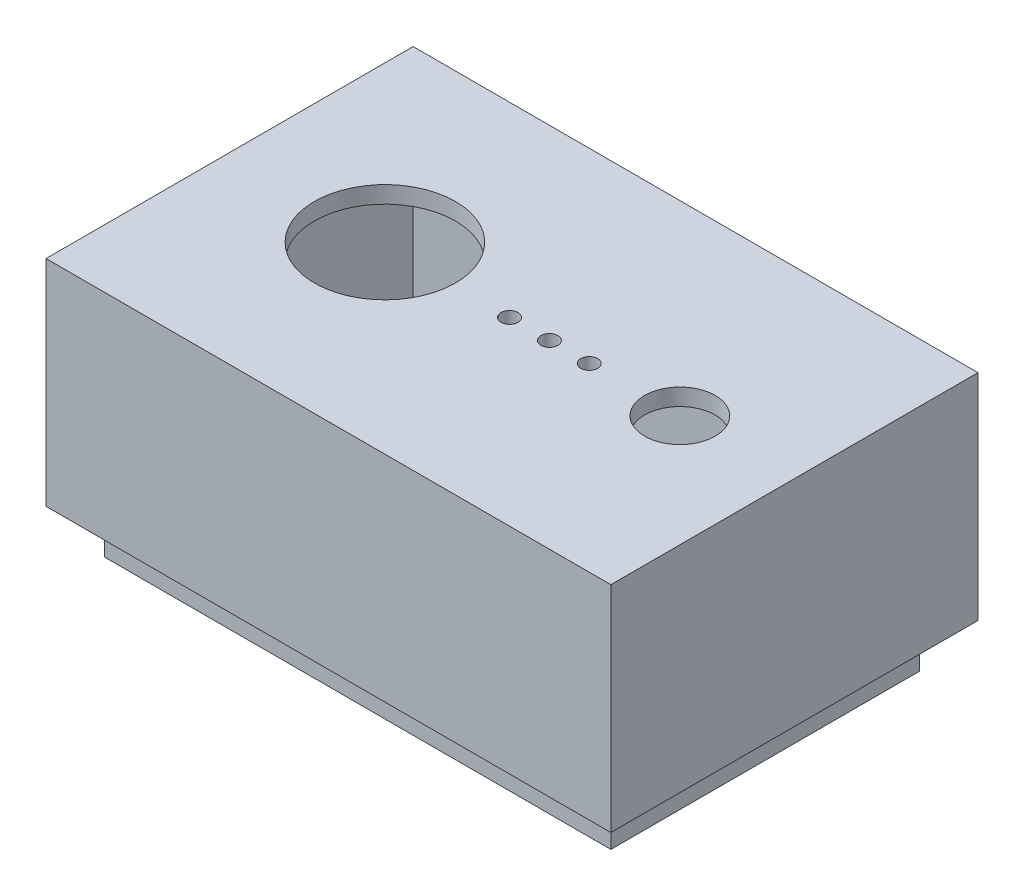
ISO-10303-21;
HEADER;
FILE_DESCRIPTION(('STEP AP214'),'2;1');
FILE_NAME('part.step','',(''),(''),'','','');
FILE_SCHEMA(('AUTOMOTIVE_DESIGN { 1 0 10303 214 1 1 1 1 }'));
ENDSEC;
DATA;
#1=APPLICATION_CONTEXT('core data for automotive mechanical design processes');
#2=APPLICATION_PROTOCOL_DEFINITION('international standard','automotive_design',2000,#1);
#3=PRODUCT_CONTEXT('',#1,'mechanical');
#4=PRODUCT('Part','Part','',(#3));
#5=PRODUCT_RELATED_PRODUCT_CATEGORY('part','',(#4));
#6=PRODUCT_DEFINITION_FORMATION('','',#4);
#7=PRODUCT_DEFINITION_CONTEXT('part definition',#1,'design');
#8=PRODUCT_DEFINITION('design','',#6,#7);
#9=PRODUCT_DEFINITION_SHAPE('','',#8);
#10=(LENGTH_UNIT() NAMED_UNIT(*) SI_UNIT(.MILLI.,.METRE.));
#11=(NAMED_UNIT(*) PLANE_ANGLE_UNIT() SI_UNIT($,.RADIAN.));
#12=(NAMED_UNIT(*) SI_UNIT($,.STERADIAN.) SOLID_ANGLE_UNIT());
#13=UNCERTAINTY_MEASURE_WITH_UNIT(LENGTH_MEASURE(1.E-05),#10,'distance_accuracy_value','');
#14=(GEOMETRIC_REPRESENTATION_CONTEXT(3) GLOBAL_UNCERTAINTY_ASSIGNED_CONTEXT((#13)) GLOBAL_UNIT_ASSIGNED_CONTEXT((#10,
#11,#12)) REPRESENTATION_CONTEXT('',''));
#15=CARTESIAN_POINT('',(0.,0.,0.));
#16=DIRECTION('',(0.,0.,1.));
#17=DIRECTION('',(1.,0.,0.));
#18=AXIS2_PLACEMENT_3D('',#15,#16,#17);
#19=CARTESIAN_POINT('',(0.,40.,0.));
#20=DIRECTION('',(0.,1.,0.));
#21=DIRECTION('',(0.,0.,1.));
#22=AXIS2_PLACEMENT_3D('',#19,#20,#21);
#23=PLANE('',#22);
#24=DIRECTION('',(0.,0.,-1.));
#25=VECTOR('',#24,1.);
#26=CARTESIAN_POINT('',(50.7322033898305,40.,0.));
#27=LINE('',#26,#25);
#28=CARTESIAN_POINT('',(50.7322033898305,40.,26.7992295839754));
#29=VERTEX_POINT('',#28);
#30=CARTESIAN_POINT('',(50.7322033898305,40.,-27.8007704160247));
#31=VERTEX_POINT('',#30);
#32=EDGE_CURVE('E255',#29,#31,#27,.T.);
#33=ORIENTED_EDGE('',*,*,#32,.T.);
#34=DIRECTION('',(-1.,0.,0.));
#35=VECTOR('',#34,1.);
#36=CARTESIAN_POINT('',(0.,40.,-27.8007704160247));
#37=LINE('',#36,#35);
#38=CARTESIAN_POINT('',(-38.8677966101695,40.,-27.8007704160247));
#39=VERTEX_POINT('',#38);
#40=EDGE_CURVE('E12',#31,#39,#37,.T.);
#41=ORIENTED_EDGE('',*,*,#40,.T.);
#42=DIRECTION('',(0.,0.,-1.));
#43=VECTOR('',#42,1.);
#44=CARTESIAN_POINT('',(-38.8677966101695,40.,0.));
#45=LINE('',#44,#43);
#46=CARTESIAN_POINT('',(-38.8677966101695,40.,26.7992295839754));
#47=VERTEX_POINT('',#46);
#48=EDGE_CURVE('E143',#47,#39,#45,.T.);
#49=ORIENTED_EDGE('',*,*,#48,.F.);
#50=DIRECTION('',(-1.,0.,0.));
#51=VECTOR('',#50,1.);
#52=CARTESIAN_POINT('',(0.,40.,26.7992295839754));
#53=LINE('',#52,#51);
#54=EDGE_CURVE('E262',#29,#47,#53,.T.);
#55=ORIENTED_EDGE('',*,*,#54,.F.);
#56=EDGE_LOOP('',(#33,#41,#49,#55));
#57=FACE_BOUND('',#56,.T.);
#58=DIRECTION('',(0.,0.,1.));
#59=VECTOR('',#58,1.);
#60=CARTESIAN_POINT('',(-44.0677966101695,40.,-33.0007704160247));
#61=LINE('',#60,#59);
#62=CARTESIAN_POINT('',(-44.0677966101695,40.,-33.0007704160247));
#63=VERTEX_POINT('',#62);
#64=CARTESIAN_POINT('',(-44.0677966101695,40.,31.9992295839753));
#65=VERTEX_POINT('',#64);
#66=EDGE_CURVE('E242',#63,#65,#61,.T.);
#67=ORIENTED_EDGE('',*,*,#66,.F.);
#68=DIRECTION('',(-1.,0.,0.));
#69=VECTOR('',#68,1.);
#70=CARTESIAN_POINT('',(-44.0677966101695,40.,-33.0007704160247));
#71=LINE('',#70,#69);
#72=CARTESIAN_POINT('',(55.9322033898305,40.,-33.0007704160247));
#73=VERTEX_POINT('',#72);
#74=EDGE_CURVE('E246',#73,#63,#71,.T.);
#75=ORIENTED_EDGE('',*,*,#74,.F.);
#76=DIRECTION('',(0.,0.,1.));
#77=VECTOR('',#76,1.);
#78=CARTESIAN_POINT('',(55.9322033898305,40.,29.9992295839753));
#79=LINE('',#78,#77);
#80=CARTESIAN_POINT('',(55.9322033898305,40.,31.9992295839753));
#81=VERTEX_POINT('',#80);
#82=EDGE_CURVE('E252',#73,#81,#79,.T.);
#83=ORIENTED_EDGE('',*,*,#82,.T.);
#84=DIRECTION('',(1.,0.,0.));
#85=VECTOR('',#84,1.);
#86=CARTESIAN_POINT('',(-44.0677966101695,40.,31.9992295839753));
#87=LINE('',#86,#85);
#88=EDGE_CURVE('E256',#65,#81,#87,.T.);
#89=ORIENTED_EDGE('',*,*,#88,.F.);
#90=EDGE_LOOP('',(#67,#75,#83,#89));
#91=FACE_BOUND('',#90,.T.);
#92=ADVANCED_FACE('F135',(#57,#91),#23,.F.);
#93=CARTESIAN_POINT('',(55.9322033898305,80.,-33.0007704160247));
#94=DIRECTION('',(-1.,0.,0.));
#95=DIRECTION('',(0.,0.,1.));
#96=AXIS2_PLACEMENT_3D('',#93,#94,#95);
#97=PLANE('',#96);
#98=DIRECTION('',(0.,-1.,0.));
#99=VECTOR('',#98,1.);
#100=CARTESIAN_POINT('',(55.9322033898305,80.,-33.0007704160247));
#101=LINE('',#100,#99);
#102=CARTESIAN_POINT('',(55.9322033898305,78.,-33.0007704160246));
#103=VERTEX_POINT('',#102);
#104=EDGE_CURVE('E248',#103,#73,#101,.T.);
#105=ORIENTED_EDGE('',*,*,#104,.F.);
#106=DIRECTION('',(0.,0.,1.));
#107=VECTOR('',#106,1.);
#108=CARTESIAN_POINT('',(55.9322033898305,78.,-103.000770416025));
#109=LINE('',#108,#107);
#110=CARTESIAN_POINT('',(55.9322033898305,78.,31.9992295839753));
#111=VERTEX_POINT('',#110);
#112=EDGE_CURVE('E229',#103,#111,#109,.T.);
#113=ORIENTED_EDGE('',*,*,#112,.T.);
#114=DIRECTION('',(0.,-1.,0.));
#115=VECTOR('',#114,1.);
#116=CARTESIAN_POINT('',(55.9322033898305,80.,31.9992295839753));
#117=LINE('',#116,#115);
#118=EDGE_CURVE('E237',#111,#81,#117,.T.);
#119=ORIENTED_EDGE('',*,*,#118,.T.);
#120=ORIENTED_EDGE('',*,*,#82,.F.);
#121=EDGE_LOOP('',(#105,#113,#119,#120));
#122=FACE_BOUND('',#121,.T.);
#123=ADVANCED_FACE('F322',(#122),#97,.F.);
#124=CARTESIAN_POINT('',(0.,75.,0.));
#125=DIRECTION('',(0.,1.,0.));
#126=DIRECTION('',(0.,0.,1.));
#127=AXIS2_PLACEMENT_3D('',#124,#125,#126);
#128=PLANE('',#127);
#129=CARTESIAN_POINT('',(5.99220099186608,75.,0.));
#130=DIRECTION('',(0.,1.,0.));
#131=DIRECTION('',(0.,0.,1.));
#132=AXIS2_PLACEMENT_3D('',#129,#130,#131);
#133=CIRCLE('',#132,1.5);
#134=CARTESIAN_POINT('',(5.99220099186608,75.,1.5));
#135=VERTEX_POINT('',#134);
#136=EDGE_CURVE('E238',#135,#135,#133,.T.);
#137=ORIENTED_EDGE('',*,*,#136,.T.);
#138=EDGE_LOOP('',(#137));
#139=FACE_BOUND('',#138,.T.);
#140=CARTESIAN_POINT('',(20.1053778472485,75.,0.));
#141=DIRECTION('',(0.,1.,0.));
#142=DIRECTION('',(0.,0.,1.));
#143=AXIS2_PLACEMENT_3D('',#140,#141,#142);
#144=CIRCLE('',#143,1.5);
#145=CARTESIAN_POINT('',(20.1053778472485,75.,1.5));
#146=VERTEX_POINT('',#145);
#147=EDGE_CURVE('E540',#146,#146,#144,.T.);
#148=ORIENTED_EDGE('',*,*,#147,.T.);
#149=EDGE_LOOP('',(#148));
#150=FACE_BOUND('',#149,.T.);
#151=CARTESIAN_POINT('',(13.0553778472485,75.,0.));
#152=DIRECTION('',(0.,1.,0.));
#153=DIRECTION('',(0.,0.,1.));
#154=AXIS2_PLACEMENT_3D('',#151,#152,#153);
#155=CIRCLE('',#154,1.5);
#156=CARTESIAN_POINT('',(13.0553778472485,75.,1.5));
#157=VERTEX_POINT('',#156);
#158=EDGE_CURVE('E543',#157,#157,#155,.T.);
#159=ORIENTED_EDGE('',*,*,#158,.T.);
#160=EDGE_LOOP('',(#159));
#161=FACE_BOUND('',#160,.T.);
#162=CARTESIAN_POINT('',(-16.56779661,75.,-0.50077041602465));
#163=DIRECTION('',(0.,-1.,0.));
#164=DIRECTION('',(0.,0.,-1.));
#165=AXIS2_PLACEMENT_3D('',#162,#163,#164);
#166=CIRCLE('',#165,12.5);
#167=CARTESIAN_POINT('',(-16.56779661,75.,-13.0007704160247));
#168=VERTEX_POINT('',#167);
#169=EDGE_CURVE('E552',#168,#168,#166,.T.);
#170=ORIENTED_EDGE('',*,*,#169,.F.);
#171=EDGE_LOOP('',(#170));
#172=FACE_BOUND('',#171,.T.);
#173=CARTESIAN_POINT('',(36.1553778472485,75.,0.));
#174=DIRECTION('',(0.,-1.,0.));
#175=DIRECTION('',(0.,0.,-1.));
#176=AXIS2_PLACEMENT_3D('',#173,#174,#175);
#177=CIRCLE('',#176,6.25);
#178=CARTESIAN_POINT('',(36.1553778472485,75.,-6.25));
#179=VERTEX_POINT('',#178);
#180=EDGE_CURVE('E555',#179,#179,#177,.T.);
#181=ORIENTED_EDGE('',*,*,#180,.F.);
#182=EDGE_LOOP('',(#181));
#183=FACE_BOUND('',#182,.T.);
#184=DIRECTION('',(-1.,0.,0.));
#185=VECTOR('',#184,1.);
#186=CARTESIAN_POINT('',(-37.8677966101695,75.,25.2992295839754));
#187=LINE('',#186,#185);
#188=CARTESIAN_POINT('',(49.2322033898305,75.,25.2992295839754));
#189=VERTEX_POINT('',#188);
#190=CARTESIAN_POINT('',(-37.3677966101695,75.,25.2992295839754));
#191=VERTEX_POINT('',#190);
#192=EDGE_CURVE('E305',#189,#191,#187,.T.);
#193=ORIENTED_EDGE('',*,*,#192,.T.);
#194=DIRECTION('',(0.,0.,-1.));
#195=VECTOR('',#194,1.);
#196=CARTESIAN_POINT('',(-37.3677966101695,75.,25.7992295839754));
#197=LINE('',#196,#195);
#198=CARTESIAN_POINT('',(-37.3677966101695,75.,-26.3007704160247));
#199=VERTEX_POINT('',#198);
#200=EDGE_CURVE('E280',#191,#199,#197,.T.);
#201=ORIENTED_EDGE('',*,*,#200,.T.);
#202=DIRECTION('',(1.,0.,0.));
#203=VECTOR('',#202,1.);
#204=CARTESIAN_POINT('',(-37.8677966101695,75.,-26.3007704160247));
#205=LINE('',#204,#203);
#206=CARTESIAN_POINT('',(49.2322033898305,75.,-26.3007704160247));
#207=VERTEX_POINT('',#206);
#208=EDGE_CURVE('E299',#199,#207,#205,.T.);
#209=ORIENTED_EDGE('',*,*,#208,.T.);
#210=DIRECTION('',(0.,0.,1.));
#211=VECTOR('',#210,1.);
#212=CARTESIAN_POINT('',(49.2322033898305,75.,25.7992295839754));
#213=LINE('',#212,#211);
#214=EDGE_CURVE('E302',#207,#189,#213,.T.);
#215=ORIENTED_EDGE('',*,*,#214,.T.);
#216=EDGE_LOOP('',(#193,#201,#209,#215));
#217=FACE_BOUND('',#216,.T.);
#218=ADVANCED_FACE('F329',(#139,#150,#161,#172,#183,#217),#128,.F.);
#219=CARTESIAN_POINT('',(-44.0677966101695,80.,-33.0007704160247));
#220=DIRECTION('',(0.,0.,1.));
#221=DIRECTION('',(1.,0.,0.));
#222=AXIS2_PLACEMENT_3D('',#219,#220,#221);
#223=PLANE('',#222);
#224=DIRECTION('',(0.,-1.,0.));
#225=VECTOR('',#224,1.);
#226=CARTESIAN_POINT('',(-44.0677966101695,80.,-33.0007704160247));
#227=LINE('',#226,#225);
#228=CARTESIAN_POINT('',(-44.0677966101695,78.,-33.0007704160247));
#229=VERTEX_POINT('',#228);
#230=EDGE_CURVE('E244',#229,#63,#227,.T.);
#231=ORIENTED_EDGE('',*,*,#230,.F.);
#232=DIRECTION('',(1.,0.,0.));
#233=VECTOR('',#232,1.);
#234=CARTESIAN_POINT('',(-44.0677966101695,78.,-33.0007704160247));
#235=LINE('',#234,#233);
#236=EDGE_CURVE('E150',#229,#103,#235,.T.);
#237=ORIENTED_EDGE('',*,*,#236,.T.);
#238=ORIENTED_EDGE('',*,*,#104,.T.);
#239=ORIENTED_EDGE('',*,*,#74,.T.);
#240=EDGE_LOOP('',(#231,#237,#238,#239));
#241=FACE_BOUND('',#240,.T.);
#242=ADVANCED_FACE('F319',(#241),#223,.F.);
#243=CARTESIAN_POINT('',(-44.0677966101695,80.,31.9992295839753));
#244=DIRECTION('',(0.,0.,-1.));
#245=DIRECTION('',(-1.,0.,0.));
#246=AXIS2_PLACEMENT_3D('',#243,#244,#245);
#247=PLANE('',#246);
#248=ORIENTED_EDGE('',*,*,#118,.F.);
#249=DIRECTION('',(1.,0.,0.));
#250=VECTOR('',#249,1.);
#251=CARTESIAN_POINT('',(-44.0677966101695,78.,31.9992295839753));
#252=LINE('',#251,#250);
#253=CARTESIAN_POINT('',(-44.0677966101695,78.,31.9992295839753));
#254=VERTEX_POINT('',#253);
#255=EDGE_CURVE('E224',#254,#111,#252,.T.);
#256=ORIENTED_EDGE('',*,*,#255,.F.);
#257=DIRECTION('',(0.,-1.,0.));
#258=VECTOR('',#257,1.);
#259=CARTESIAN_POINT('',(-44.0677966101695,80.,31.9992295839753));
#260=LINE('',#259,#258);
#261=EDGE_CURVE('E235',#254,#65,#260,.T.);
#262=ORIENTED_EDGE('',*,*,#261,.T.);
#263=ORIENTED_EDGE('',*,*,#88,.T.);
#264=EDGE_LOOP('',(#248,#256,#262,#263));
#265=FACE_BOUND('',#264,.T.);
#266=ADVANCED_FACE('F233',(#265),#247,.F.);
#267=CARTESIAN_POINT('',(-44.0677966101695,80.,-33.0007704160247));
#268=DIRECTION('',(1.,0.,0.));
#269=DIRECTION('',(0.,0.,-1.));
#270=AXIS2_PLACEMENT_3D('',#267,#268,#269);
#271=PLANE('',#270);
#272=ORIENTED_EDGE('',*,*,#261,.F.);
#273=DIRECTION('',(0.,0.,1.));
#274=VECTOR('',#273,1.);
#275=CARTESIAN_POINT('',(-44.0677966101695,78.,-103.000770416025));
#276=LINE('',#275,#274);
#277=EDGE_CURVE('E221',#229,#254,#276,.T.);
#278=ORIENTED_EDGE('',*,*,#277,.F.);
#279=ORIENTED_EDGE('',*,*,#230,.T.);
#280=ORIENTED_EDGE('',*,*,#66,.T.);
#281=EDGE_LOOP('',(#272,#278,#279,#280));
#282=FACE_BOUND('',#281,.T.);
#283=ADVANCED_FACE('F240',(#282),#271,.F.);
#284=CARTESIAN_POINT('',(-37.3677966101695,32.,25.7992295839754));
#285=DIRECTION('',(1.,0.,0.));
#286=DIRECTION('',(0.,0.,-1.));
#287=AXIS2_PLACEMENT_3D('',#284,#285,#286);
#288=PLANE('',#287);
#289=DIRECTION('',(0.,1.,0.));
#290=VECTOR('',#289,1.);
#291=CARTESIAN_POINT('',(-37.3677966101695,32.,-26.3007704160247));
#292=LINE('',#291,#290);
#293=CARTESIAN_POINT('',(-37.3677966101695,32.2018522868434,-26.3007704160247));
#294=VERTEX_POINT('',#293);
#295=EDGE_CURVE('E314',#294,#199,#292,.T.);
#296=ORIENTED_EDGE('',*,*,#295,.T.);
#297=ORIENTED_EDGE('',*,*,#200,.F.);
#298=DIRECTION('',(0.,1.,0.));
#299=VECTOR('',#298,1.);
#300=CARTESIAN_POINT('',(-37.3677966101695,32.,25.2992295839754));
#301=LINE('',#300,#299);
#302=CARTESIAN_POINT('',(-37.3677966101695,32.2018522868434,25.2992295839754));
#303=VERTEX_POINT('',#302);
#304=EDGE_CURVE('E308',#303,#191,#301,.T.);
#305=ORIENTED_EDGE('',*,*,#304,.F.);
#306=DIRECTION('',(0.,0.,1.));
#307=VECTOR('',#306,1.);
#308=CARTESIAN_POINT('',(-37.3677966101695,32.2018522868434,-27.8007704160247));
#309=LINE('',#308,#307);
#310=EDGE_CURVE('E567',#294,#303,#309,.T.);
#311=ORIENTED_EDGE('',*,*,#310,.F.);
#312=EDGE_LOOP('',(#296,#297,#305,#311));
#313=FACE_BOUND('',#312,.T.);
#314=ADVANCED_FACE('F338',(#313),#288,.T.);
#315=CARTESIAN_POINT('',(-37.8677966101695,32.,-26.3007704160247));
#316=DIRECTION('',(0.,0.,1.));
#317=DIRECTION('',(1.,0.,0.));
#318=AXIS2_PLACEMENT_3D('',#315,#316,#317);
#319=PLANE('',#318);
#320=DIRECTION('',(0.,1.,0.));
#321=VECTOR('',#320,1.);
#322=CARTESIAN_POINT('',(49.2322033898305,32.,-26.3007704160247));
#323=LINE('',#322,#321);
#324=CARTESIAN_POINT('',(49.2322033898305,32.2018522868434,-26.3007704160247));
#325=VERTEX_POINT('',#324);
#326=EDGE_CURVE('E312',#325,#207,#323,.T.);
#327=ORIENTED_EDGE('',*,*,#326,.T.);
#328=ORIENTED_EDGE('',*,*,#208,.F.);
#329=ORIENTED_EDGE('',*,*,#295,.F.);
#330=DIRECTION('',(1.,0.,0.));
#331=VECTOR('',#330,1.);
#332=CARTESIAN_POINT('',(-38.8677966101695,32.2018522868434,-26.3007704160247));
#333=LINE('',#332,#331);
#334=EDGE_CURVE('E558',#294,#325,#333,.T.);
#335=ORIENTED_EDGE('',*,*,#334,.T.);
#336=EDGE_LOOP('',(#327,#328,#329,#335));
#337=FACE_BOUND('',#336,.T.);
#338=ADVANCED_FACE('F346',(#337),#319,.T.);
#339=CARTESIAN_POINT('',(49.2322033898305,32.,25.7992295839754));
#340=DIRECTION('',(-1.,0.,0.));
#341=DIRECTION('',(0.,0.,1.));
#342=AXIS2_PLACEMENT_3D('',#339,#340,#341);
#343=PLANE('',#342);
#344=DIRECTION('',(0.,1.,0.));
#345=VECTOR('',#344,1.);
#346=CARTESIAN_POINT('',(49.2322033898305,32.,25.2992295839754));
#347=LINE('',#346,#345);
#348=CARTESIAN_POINT('',(49.2322033898305,32.2018522868434,25.2992295839754));
#349=VERTEX_POINT('',#348);
#350=EDGE_CURVE('E310',#349,#189,#347,.T.);
#351=ORIENTED_EDGE('',*,*,#350,.T.);
#352=ORIENTED_EDGE('',*,*,#214,.F.);
#353=ORIENTED_EDGE('',*,*,#326,.F.);
#354=DIRECTION('',(0.,0.,1.));
#355=VECTOR('',#354,1.);
#356=CARTESIAN_POINT('',(49.2322033898305,32.2018522868434,-27.8007704160247));
#357=LINE('',#356,#355);
#358=EDGE_CURVE('E561',#325,#349,#357,.T.);
#359=ORIENTED_EDGE('',*,*,#358,.T.);
#360=EDGE_LOOP('',(#351,#352,#353,#359));
#361=FACE_BOUND('',#360,.T.);
#362=ADVANCED_FACE('F416',(#361),#343,.T.);
#363=CARTESIAN_POINT('',(-37.8677966101695,32.,25.2992295839754));
#364=DIRECTION('',(0.,0.,-1.));
#365=DIRECTION('',(-1.,0.,0.));
#366=AXIS2_PLACEMENT_3D('',#363,#364,#365);
#367=PLANE('',#366);
#368=ORIENTED_EDGE('',*,*,#304,.T.);
#369=ORIENTED_EDGE('',*,*,#192,.F.);
#370=ORIENTED_EDGE('',*,*,#350,.F.);
#371=DIRECTION('',(1.,0.,0.));
#372=VECTOR('',#371,1.);
#373=CARTESIAN_POINT('',(-38.8677966101695,32.2018522868434,25.2992295839754));
#374=LINE('',#373,#372);
#375=EDGE_CURVE('E564',#303,#349,#374,.T.);
#376=ORIENTED_EDGE('',*,*,#375,.F.);
#377=EDGE_LOOP('',(#368,#369,#370,#376));
#378=FACE_BOUND('',#377,.T.);
#379=ADVANCED_FACE('F426',(#378),#367,.T.);
#380=CARTESIAN_POINT('',(-38.8677966101695,40.0018522868434,-27.8007704160247));
#381=DIRECTION('',(0.,0.,-1.));
#382=DIRECTION('',(-1.,0.,0.));
#383=AXIS2_PLACEMENT_3D('',#380,#381,#382);
#384=PLANE('',#383);
#385=ORIENTED_EDGE('',*,*,#40,.F.);
#386=DIRECTION('',(0.,-1.,0.));
#387=VECTOR('',#386,1.);
#388=CARTESIAN_POINT('',(50.7322033898305,40.0018522868434,-27.8007704160247));
#389=LINE('',#388,#387);
#390=CARTESIAN_POINT('',(50.7322033898305,32.2018522868434,-27.8007704160247));
#391=VERTEX_POINT('',#390);
#392=EDGE_CURVE('E158',#31,#391,#389,.T.);
#393=ORIENTED_EDGE('',*,*,#392,.T.);
#394=DIRECTION('',(1.,0.,0.));
#395=VECTOR('',#394,1.);
#396=CARTESIAN_POINT('',(-38.8677966101695,32.2018522868434,-27.8007704160247));
#397=LINE('',#396,#395);
#398=CARTESIAN_POINT('',(-38.8677966101695,32.2018522868434,-27.8007704160247));
#399=VERTEX_POINT('',#398);
#400=EDGE_CURVE('E279',#399,#391,#397,.T.);
#401=ORIENTED_EDGE('',*,*,#400,.F.);
#402=DIRECTION('',(0.,-1.,0.));
#403=VECTOR('',#402,1.);
#404=CARTESIAN_POINT('',(-38.8677966101695,40.0018522868434,-27.8007704160247));
#405=LINE('',#404,#403);
#406=EDGE_CURVE('E270',#39,#399,#405,.T.);
#407=ORIENTED_EDGE('',*,*,#406,.F.);
#408=EDGE_LOOP('',(#385,#393,#401,#407));
#409=FACE_BOUND('',#408,.T.);
#410=ADVANCED_FACE('F277',(#409),#384,.T.);
#411=CARTESIAN_POINT('',(-38.8677966101695,40.0018522868434,-27.8007704160247));
#412=DIRECTION('',(1.,0.,0.));
#413=DIRECTION('',(0.,0.,-1.));
#414=AXIS2_PLACEMENT_3D('',#411,#412,#413);
#415=PLANE('',#414);
#416=DIRECTION('',(0.,-1.,0.));
#417=VECTOR('',#416,1.);
#418=CARTESIAN_POINT('',(-38.8677966101695,40.0018522868434,26.7992295839754));
#419=LINE('',#418,#417);
#420=CARTESIAN_POINT('',(-38.8677966101695,32.2018522868434,26.7992295839754));
#421=VERTEX_POINT('',#420);
#422=EDGE_CURVE('E272',#47,#421,#419,.T.);
#423=ORIENTED_EDGE('',*,*,#422,.F.);
#424=ORIENTED_EDGE('',*,*,#48,.T.);
#425=ORIENTED_EDGE('',*,*,#406,.T.);
#426=DIRECTION('',(0.,0.,1.));
#427=VECTOR('',#426,1.);
#428=CARTESIAN_POINT('',(-38.8677966101695,32.2018522868434,-27.8007704160247));
#429=LINE('',#428,#427);
#430=EDGE_CURVE('E294',#399,#421,#429,.T.);
#431=ORIENTED_EDGE('',*,*,#430,.T.);
#432=EDGE_LOOP('',(#423,#424,#425,#431));
#433=FACE_BOUND('',#432,.T.);
#434=ADVANCED_FACE('F268',(#433),#415,.F.);
#435=CARTESIAN_POINT('',(-38.8677966101695,40.0018522868434,26.7992295839754));
#436=DIRECTION('',(0.,0.,-1.));
#437=DIRECTION('',(-1.,0.,0.));
#438=AXIS2_PLACEMENT_3D('',#435,#436,#437);
#439=PLANE('',#438);
#440=DIRECTION('',(0.,-1.,0.));
#441=VECTOR('',#440,1.);
#442=CARTESIAN_POINT('',(50.7322033898305,40.0018522868434,26.7992295839754));
#443=LINE('',#442,#441);
#444=CARTESIAN_POINT('',(50.7322033898305,32.2018522868434,26.7992295839754));
#445=VERTEX_POINT('',#444);
#446=EDGE_CURVE('E285',#29,#445,#443,.T.);
#447=ORIENTED_EDGE('',*,*,#446,.F.);
#448=ORIENTED_EDGE('',*,*,#54,.T.);
#449=ORIENTED_EDGE('',*,*,#422,.T.);
#450=DIRECTION('',(1.,0.,0.));
#451=VECTOR('',#450,1.);
#452=CARTESIAN_POINT('',(-38.8677966101695,32.2018522868434,26.7992295839754));
#453=LINE('',#452,#451);
#454=EDGE_CURVE('E290',#421,#445,#453,.T.);
#455=ORIENTED_EDGE('',*,*,#454,.T.);
#456=EDGE_LOOP('',(#447,#448,#449,#455));
#457=FACE_BOUND('',#456,.T.);
#458=ADVANCED_FACE('F288',(#457),#439,.F.);
#459=CARTESIAN_POINT('',(50.7322033898305,40.0018522868434,-27.8007704160247));
#460=DIRECTION('',(1.,0.,0.));
#461=DIRECTION('',(0.,0.,-1.));
#462=AXIS2_PLACEMENT_3D('',#459,#460,#461);
#463=PLANE('',#462);
#464=ORIENTED_EDGE('',*,*,#32,.F.);
#465=ORIENTED_EDGE('',*,*,#446,.T.);
#466=DIRECTION('',(0.,0.,1.));
#467=VECTOR('',#466,1.);
#468=CARTESIAN_POINT('',(50.7322033898305,32.2018522868434,-27.8007704160247));
#469=LINE('',#468,#467);
#470=EDGE_CURVE('E571',#391,#445,#469,.T.);
#471=ORIENTED_EDGE('',*,*,#470,.F.);
#472=ORIENTED_EDGE('',*,*,#392,.F.);
#473=EDGE_LOOP('',(#464,#465,#471,#472));
#474=FACE_BOUND('',#473,.T.);
#475=ADVANCED_FACE('F284',(#474),#463,.T.);
#476=CARTESIAN_POINT('',(0.,32.2018522868434,0.));
#477=DIRECTION('',(0.,-1.,0.));
#478=DIRECTION('',(0.,0.,-1.));
#479=AXIS2_PLACEMENT_3D('',#476,#477,#478);
#480=PLANE('',#479);
#481=ORIENTED_EDGE('',*,*,#334,.F.);
#482=ORIENTED_EDGE('',*,*,#310,.T.);
#483=ORIENTED_EDGE('',*,*,#375,.T.);
#484=ORIENTED_EDGE('',*,*,#358,.F.);
#485=EDGE_LOOP('',(#481,#482,#483,#484));
#486=FACE_BOUND('',#485,.T.);
#487=ORIENTED_EDGE('',*,*,#400,.T.);
#488=ORIENTED_EDGE('',*,*,#470,.T.);
#489=ORIENTED_EDGE('',*,*,#454,.F.);
#490=ORIENTED_EDGE('',*,*,#430,.F.);
#491=EDGE_LOOP('',(#487,#488,#489,#490));
#492=FACE_BOUND('',#491,.T.);
#493=ADVANCED_FACE('F469',(#486,#492),#480,.T.);
#494=CARTESIAN_POINT('',(36.1553778472485,112.8,0.));
#495=DIRECTION('',(0.,-1.,0.));
#496=DIRECTION('',(0.,0.,-1.));
#497=AXIS2_PLACEMENT_3D('',#494,#495,#496);
#498=CYLINDRICAL_SURFACE('',#497,6.25);
#499=CARTESIAN_POINT('',(36.1553778472485,78.,0.));
#500=DIRECTION('',(0.,-1.,0.));
#501=DIRECTION('',(0.,0.,-1.));
#502=AXIS2_PLACEMENT_3D('',#499,#500,#501);
#503=CIRCLE('',#502,6.25);
#504=CARTESIAN_POINT('',(36.1553778472485,78.,-6.25));
#505=VERTEX_POINT('',#504);
#506=EDGE_CURVE('E548',#505,#505,#503,.F.);
#507=ORIENTED_EDGE('',*,*,#506,.T.);
#508=EDGE_LOOP('',(#507));
#509=FACE_BOUND('',#508,.T.);
#510=ORIENTED_EDGE('',*,*,#180,.T.);
#511=EDGE_LOOP('',(#510));
#512=FACE_BOUND('',#511,.T.);
#513=ADVANCED_FACE('F475',(#509,#512),#498,.F.);
#514=CARTESIAN_POINT('',(-16.56779661,80.,-0.50077041602465));
#515=DIRECTION('',(0.,-1.,0.));
#516=DIRECTION('',(0.,0.,-1.));
#517=AXIS2_PLACEMENT_3D('',#514,#515,#516);
#518=CYLINDRICAL_SURFACE('',#517,12.5);
#519=CARTESIAN_POINT('',(-16.56779661,78.,-0.50077041602465));
#520=DIRECTION('',(0.,-1.,0.));
#521=DIRECTION('',(0.,0.,-1.));
#522=AXIS2_PLACEMENT_3D('',#519,#520,#521);
#523=CIRCLE('',#522,12.5);
#524=CARTESIAN_POINT('',(-16.56779661,78.,-13.0007704160247));
#525=VERTEX_POINT('',#524);
#526=EDGE_CURVE('E138',#525,#525,#523,.F.);
#527=ORIENTED_EDGE('',*,*,#526,.T.);
#528=EDGE_LOOP('',(#527));
#529=FACE_BOUND('',#528,.T.);
#530=ORIENTED_EDGE('',*,*,#169,.T.);
#531=EDGE_LOOP('',(#530));
#532=FACE_BOUND('',#531,.T.);
#533=ADVANCED_FACE('F482',(#529,#532),#518,.F.);
#534=CARTESIAN_POINT('',(-44.0677966101695,78.,-103.000770416025));
#535=DIRECTION('',(0.,-1.,0.));
#536=DIRECTION('',(0.,0.,-1.));
#537=AXIS2_PLACEMENT_3D('',#534,#535,#536);
#538=PLANE('',#537);
#539=CARTESIAN_POINT('',(5.99220099186608,78.,0.));
#540=DIRECTION('',(0.,1.,0.));
#541=DIRECTION('',(0.,0.,1.));
#542=AXIS2_PLACEMENT_3D('',#539,#540,#541);
#543=CIRCLE('',#542,1.5);
#544=CARTESIAN_POINT('',(5.99220099186608,78.,1.5));
#545=VERTEX_POINT('',#544);
#546=EDGE_CURVE('E537',#545,#545,#543,.T.);
#547=ORIENTED_EDGE('',*,*,#546,.F.);
#548=EDGE_LOOP('',(#547));
#549=FACE_BOUND('',#548,.T.);
#550=CARTESIAN_POINT('',(20.1053778472485,78.,0.));
#551=DIRECTION('',(0.,1.,0.));
#552=DIRECTION('',(0.,0.,1.));
#553=AXIS2_PLACEMENT_3D('',#550,#551,#552);
#554=CIRCLE('',#553,1.5);
#555=CARTESIAN_POINT('',(20.1053778472485,78.,1.5));
#556=VERTEX_POINT('',#555);
#557=EDGE_CURVE('E600',#556,#556,#554,.T.);
#558=ORIENTED_EDGE('',*,*,#557,.F.);
#559=EDGE_LOOP('',(#558));
#560=FACE_BOUND('',#559,.T.);
#561=CARTESIAN_POINT('',(13.0553778472485,78.,0.));
#562=DIRECTION('',(0.,1.,0.));
#563=DIRECTION('',(0.,0.,1.));
#564=AXIS2_PLACEMENT_3D('',#561,#562,#563);
#565=CIRCLE('',#564,1.5);
#566=CARTESIAN_POINT('',(13.0553778472485,78.,1.5));
#567=VERTEX_POINT('',#566);
#568=EDGE_CURVE('E597',#567,#567,#565,.T.);
#569=ORIENTED_EDGE('',*,*,#568,.F.);
#570=EDGE_LOOP('',(#569));
#571=FACE_BOUND('',#570,.T.);
#572=ORIENTED_EDGE('',*,*,#526,.F.);
#573=EDGE_LOOP('',(#572));
#574=FACE_BOUND('',#573,.T.);
#575=ORIENTED_EDGE('',*,*,#506,.F.);
#576=EDGE_LOOP('',(#575));
#577=FACE_BOUND('',#576,.T.);
#578=ORIENTED_EDGE('',*,*,#277,.T.);
#579=ORIENTED_EDGE('',*,*,#255,.T.);
#580=ORIENTED_EDGE('',*,*,#112,.F.);
#581=ORIENTED_EDGE('',*,*,#236,.F.);
#582=EDGE_LOOP('',(#578,#579,#580,#581));
#583=FACE_BOUND('',#582,.T.);
#584=ADVANCED_FACE('F223',(#549,#560,#571,#574,#577,#583),#538,.F.);
#585=CARTESIAN_POINT('',(13.0553778472485,-57.,0.));
#586=DIRECTION('',(0.,1.,0.));
#587=DIRECTION('',(0.,0.,1.));
#588=AXIS2_PLACEMENT_3D('',#585,#586,#587);
#589=CYLINDRICAL_SURFACE('',#588,1.5);
#590=ORIENTED_EDGE('',*,*,#568,.T.);
#591=EDGE_LOOP('',(#590));
#592=FACE_BOUND('',#591,.T.);
#593=ORIENTED_EDGE('',*,*,#158,.F.);
#594=EDGE_LOOP('',(#593));
#595=FACE_BOUND('',#594,.T.);
#596=ADVANCED_FACE('F502',(#592,#595),#589,.F.);
#597=CARTESIAN_POINT('',(20.1053778472485,-57.,0.));
#598=DIRECTION('',(0.,1.,0.));
#599=DIRECTION('',(0.,0.,1.));
#600=AXIS2_PLACEMENT_3D('',#597,#598,#599);
#601=CYLINDRICAL_SURFACE('',#600,1.5);
#602=ORIENTED_EDGE('',*,*,#557,.T.);
#603=EDGE_LOOP('',(#602));
#604=FACE_BOUND('',#603,.T.);
#605=ORIENTED_EDGE('',*,*,#147,.F.);
#606=EDGE_LOOP('',(#605));
#607=FACE_BOUND('',#606,.T.);
#608=ADVANCED_FACE('F510',(#604,#607),#601,.F.);
#609=CARTESIAN_POINT('',(5.99220099186608,-57.,0.));
#610=DIRECTION('',(0.,1.,0.));
#611=DIRECTION('',(0.,0.,1.));
#612=AXIS2_PLACEMENT_3D('',#609,#610,#611);
#613=CYLINDRICAL_SURFACE('',#612,1.5);
#614=ORIENTED_EDGE('',*,*,#546,.T.);
#615=EDGE_LOOP('',(#614));
#616=FACE_BOUND('',#615,.T.);
#617=ORIENTED_EDGE('',*,*,#136,.F.);
#618=EDGE_LOOP('',(#617));
#619=FACE_BOUND('',#618,.T.);
#620=ADVANCED_FACE('F520',(#616,#619),#613,.F.);
#621=CLOSED_SHELL('',(#92,#123,#218,#242,#266,#283,#314,#338,#362,#379,#410,#434,#458,#475,#493,
#513,#533,#584,#596,#608,#620));
#622=MANIFOLD_SOLID_BREP('B2',#621);
#623=ADVANCED_BREP_SHAPE_REPRESENTATION('',(#18,#622),#14);
#624=SHAPE_DEFINITION_REPRESENTATION(#9,#623);
ENDSEC;
END-ISO-10303-21;
